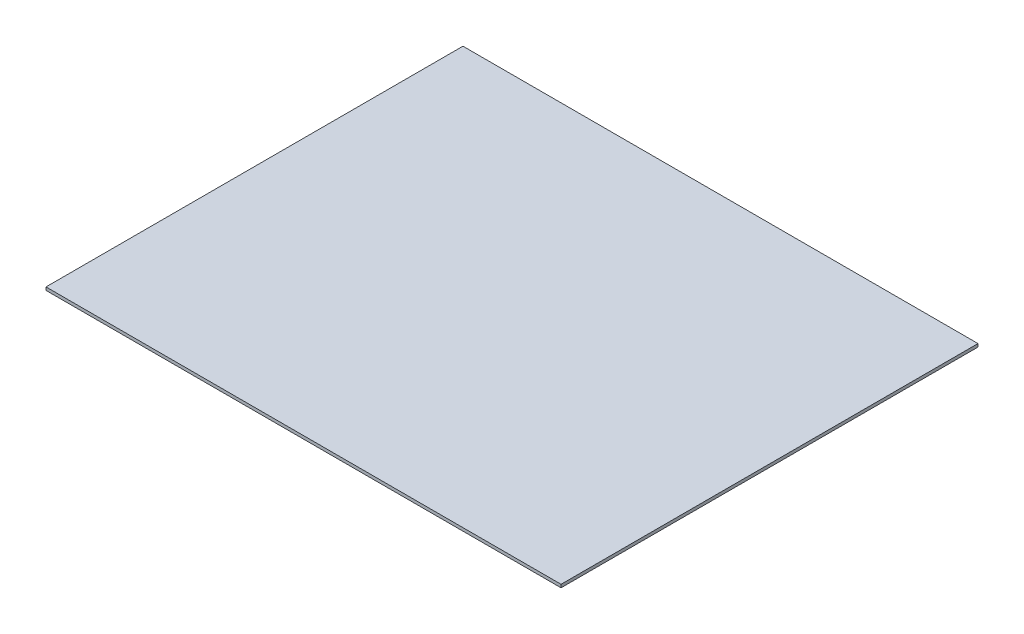
ISO-10303-21;
HEADER;
FILE_DESCRIPTION(('STEP AP214'),'2;1');
FILE_NAME('part.step','',(''),(''),'','','');
FILE_SCHEMA(('AUTOMOTIVE_DESIGN { 1 0 10303 214 1 1 1 1 }'));
ENDSEC;
DATA;
#1=APPLICATION_CONTEXT('core data for automotive mechanical design processes');
#2=APPLICATION_PROTOCOL_DEFINITION('international standard','automotive_design',2000,#1);
#3=PRODUCT_CONTEXT('',#1,'mechanical');
#4=PRODUCT('Part','Part','',(#3));
#5=PRODUCT_RELATED_PRODUCT_CATEGORY('part','',(#4));
#6=PRODUCT_DEFINITION_FORMATION('','',#4);
#7=PRODUCT_DEFINITION_CONTEXT('part definition',#1,'design');
#8=PRODUCT_DEFINITION('design','',#6,#7);
#9=PRODUCT_DEFINITION_SHAPE('','',#8);
#10=(LENGTH_UNIT() NAMED_UNIT(*) SI_UNIT(.MILLI.,.METRE.));
#11=(NAMED_UNIT(*) PLANE_ANGLE_UNIT() SI_UNIT($,.RADIAN.));
#12=(NAMED_UNIT(*) SI_UNIT($,.STERADIAN.) SOLID_ANGLE_UNIT());
#13=UNCERTAINTY_MEASURE_WITH_UNIT(LENGTH_MEASURE(1.E-05),#10,'distance_accuracy_value','');
#14=(GEOMETRIC_REPRESENTATION_CONTEXT(3) GLOBAL_UNCERTAINTY_ASSIGNED_CONTEXT((#13)) GLOBAL_UNIT_ASSIGNED_CONTEXT((#10,
#11,#12)) REPRESENTATION_CONTEXT('',''));
#15=CARTESIAN_POINT('',(0.,0.,0.));
#16=DIRECTION('',(0.,0.,1.));
#17=DIRECTION('',(1.,0.,0.));
#18=AXIS2_PLACEMENT_3D('',#15,#16,#17);
#19=CARTESIAN_POINT('',(-2487.94392662049,-3.175,0.));
#20=DIRECTION('',(0.,0.,-1.));
#21=DIRECTION('',(-1.,0.,0.));
#22=AXIS2_PLACEMENT_3D('',#19,#20,#21);
#23=PLANE('',#22);
#24=DIRECTION('',(-1.,0.,0.));
#25=VECTOR('',#24,1.);
#26=CARTESIAN_POINT('',(-2487.94392662049,0.,0.));
#27=LINE('',#26,#25);
#28=CARTESIAN_POINT('',(-2221.24392662049,0.,0.));
#29=VERTEX_POINT('',#28);
#30=CARTESIAN_POINT('',(-2754.64392662048,0.,-1.38777878078145E-13));
#31=VERTEX_POINT('',#30);
#32=EDGE_CURVE('E99',#29,#31,#27,.T.);
#33=ORIENTED_EDGE('',*,*,#32,.F.);
#34=DIRECTION('',(0.,1.,0.));
#35=VECTOR('',#34,1.);
#36=CARTESIAN_POINT('',(-2221.24392662049,-3.175,0.));
#37=LINE('',#36,#35);
#38=CARTESIAN_POINT('',(-2221.24392662049,-3.175,0.));
#39=VERTEX_POINT('',#38);
#40=EDGE_CURVE('E9',#39,#29,#37,.T.);
#41=ORIENTED_EDGE('',*,*,#40,.F.);
#42=DIRECTION('',(-1.,0.,0.));
#43=VECTOR('',#42,1.);
#44=CARTESIAN_POINT('',(-2487.94392662049,-3.175,0.));
#45=LINE('',#44,#43);
#46=CARTESIAN_POINT('',(-2754.64392662048,-3.175,-1.38777878078145E-13));
#47=VERTEX_POINT('',#46);
#48=EDGE_CURVE('E77',#39,#47,#45,.T.);
#49=ORIENTED_EDGE('',*,*,#48,.T.);
#50=DIRECTION('',(0.,1.,0.));
#51=VECTOR('',#50,1.);
#52=CARTESIAN_POINT('',(-2754.64392662048,-3.175,-1.38777878078145E-13));
#53=LINE('',#52,#51);
#54=EDGE_CURVE('E36',#47,#31,#53,.T.);
#55=ORIENTED_EDGE('',*,*,#54,.T.);
#56=EDGE_LOOP('',(#33,#41,#49,#55));
#57=FACE_BOUND('',#56,.T.);
#58=ADVANCED_FACE('F14',(#57),#23,.T.);
#59=CARTESIAN_POINT('',(-2221.24392662049,-3.175,215.9));
#60=DIRECTION('',(-1.,0.,0.));
#61=DIRECTION('',(0.,0.,1.));
#62=AXIS2_PLACEMENT_3D('',#59,#60,#61);
#63=PLANE('',#62);
#64=DIRECTION('',(0.,0.,1.));
#65=VECTOR('',#64,1.);
#66=CARTESIAN_POINT('',(-2221.24392662049,0.,215.9));
#67=LINE('',#66,#65);
#68=CARTESIAN_POINT('',(-2221.24392662049,0.,431.8));
#69=VERTEX_POINT('',#68);
#70=EDGE_CURVE('E84',#29,#69,#67,.T.);
#71=ORIENTED_EDGE('',*,*,#70,.T.);
#72=DIRECTION('',(0.,1.,0.));
#73=VECTOR('',#72,1.);
#74=CARTESIAN_POINT('',(-2221.24392662049,-3.175,431.8));
#75=LINE('',#74,#73);
#76=CARTESIAN_POINT('',(-2221.24392662049,-3.175,431.8));
#77=VERTEX_POINT('',#76);
#78=EDGE_CURVE('E23',#77,#69,#75,.T.);
#79=ORIENTED_EDGE('',*,*,#78,.F.);
#80=DIRECTION('',(0.,0.,1.));
#81=VECTOR('',#80,1.);
#82=CARTESIAN_POINT('',(-2221.24392662049,-3.175,215.9));
#83=LINE('',#82,#81);
#84=EDGE_CURVE('E71',#39,#77,#83,.T.);
#85=ORIENTED_EDGE('',*,*,#84,.F.);
#86=ORIENTED_EDGE('',*,*,#40,.T.);
#87=EDGE_LOOP('',(#71,#79,#85,#86));
#88=FACE_BOUND('',#87,.T.);
#89=ADVANCED_FACE('F82',(#88),#63,.F.);
#90=CARTESIAN_POINT('',(-2487.94392662049,-3.175,431.8));
#91=DIRECTION('',(0.,0.,-1.));
#92=DIRECTION('',(-1.,0.,0.));
#93=AXIS2_PLACEMENT_3D('',#90,#91,#92);
#94=PLANE('',#93);
#95=DIRECTION('',(-1.,0.,0.));
#96=VECTOR('',#95,1.);
#97=CARTESIAN_POINT('',(-2487.94392662049,0.,431.8));
#98=LINE('',#97,#96);
#99=CARTESIAN_POINT('',(-2754.64392662048,0.,431.8));
#100=VERTEX_POINT('',#99);
#101=EDGE_CURVE('E103',#69,#100,#98,.T.);
#102=ORIENTED_EDGE('',*,*,#101,.T.);
#103=DIRECTION('',(0.,1.,0.));
#104=VECTOR('',#103,1.);
#105=CARTESIAN_POINT('',(-2754.64392662048,-3.175,431.8));
#106=LINE('',#105,#104);
#107=CARTESIAN_POINT('',(-2754.64392662048,-3.175,431.8));
#108=VERTEX_POINT('',#107);
#109=EDGE_CURVE('E55',#108,#100,#106,.T.);
#110=ORIENTED_EDGE('',*,*,#109,.F.);
#111=DIRECTION('',(-1.,0.,0.));
#112=VECTOR('',#111,1.);
#113=CARTESIAN_POINT('',(-2487.94392662049,-3.175,431.8));
#114=LINE('',#113,#112);
#115=EDGE_CURVE('E76',#77,#108,#114,.T.);
#116=ORIENTED_EDGE('',*,*,#115,.F.);
#117=ORIENTED_EDGE('',*,*,#78,.T.);
#118=EDGE_LOOP('',(#102,#110,#116,#117));
#119=FACE_BOUND('',#118,.T.);
#120=ADVANCED_FACE('F88',(#119),#94,.F.);
#121=CARTESIAN_POINT('',(-2754.64392662048,-3.175,215.9));
#122=DIRECTION('',(-1.,0.,0.));
#123=DIRECTION('',(0.,0.,1.));
#124=AXIS2_PLACEMENT_3D('',#121,#122,#123);
#125=PLANE('',#124);
#126=DIRECTION('',(0.,0.,1.));
#127=VECTOR('',#126,1.);
#128=CARTESIAN_POINT('',(-2754.64392662048,0.,215.9));
#129=LINE('',#128,#127);
#130=EDGE_CURVE('E105',#31,#100,#129,.T.);
#131=ORIENTED_EDGE('',*,*,#130,.F.);
#132=ORIENTED_EDGE('',*,*,#54,.F.);
#133=DIRECTION('',(0.,0.,1.));
#134=VECTOR('',#133,1.);
#135=CARTESIAN_POINT('',(-2754.64392662048,-3.175,215.9));
#136=LINE('',#135,#134);
#137=EDGE_CURVE('E90',#47,#108,#136,.T.);
#138=ORIENTED_EDGE('',*,*,#137,.T.);
#139=ORIENTED_EDGE('',*,*,#109,.T.);
#140=EDGE_LOOP('',(#131,#132,#138,#139));
#141=FACE_BOUND('',#140,.T.);
#142=ADVANCED_FACE('F120',(#141),#125,.T.);
#143=CARTESIAN_POINT('',(-2487.94392662049,-3.175,215.9));
#144=DIRECTION('',(0.,-1.,0.));
#145=DIRECTION('',(1.,0.,0.));
#146=AXIS2_PLACEMENT_3D('',#143,#144,#145);
#147=PLANE('',#146);
#148=ORIENTED_EDGE('',*,*,#48,.F.);
#149=ORIENTED_EDGE('',*,*,#84,.T.);
#150=ORIENTED_EDGE('',*,*,#115,.T.);
#151=ORIENTED_EDGE('',*,*,#137,.F.);
#152=EDGE_LOOP('',(#148,#149,#150,#151));
#153=FACE_BOUND('',#152,.T.);
#154=ADVANCED_FACE('F73',(#153),#147,.T.);
#155=CARTESIAN_POINT('',(-2487.94392662049,0.,215.9));
#156=DIRECTION('',(0.,-1.,0.));
#157=DIRECTION('',(1.,0.,0.));
#158=AXIS2_PLACEMENT_3D('',#155,#156,#157);
#159=PLANE('',#158);
#160=ORIENTED_EDGE('',*,*,#32,.T.);
#161=ORIENTED_EDGE('',*,*,#130,.T.);
#162=ORIENTED_EDGE('',*,*,#101,.F.);
#163=ORIENTED_EDGE('',*,*,#70,.F.);
#164=EDGE_LOOP('',(#160,#161,#162,#163));
#165=FACE_BOUND('',#164,.T.);
#166=ADVANCED_FACE('F128',(#165),#159,.F.);
#167=CLOSED_SHELL('',(#58,#89,#120,#142,#154,#166));
#168=MANIFOLD_SOLID_BREP('B1',#167);
#169=ADVANCED_BREP_SHAPE_REPRESENTATION('',(#18,#168),#14);
#170=SHAPE_DEFINITION_REPRESENTATION(#9,#169);
ENDSEC;
END-ISO-10303-21;
